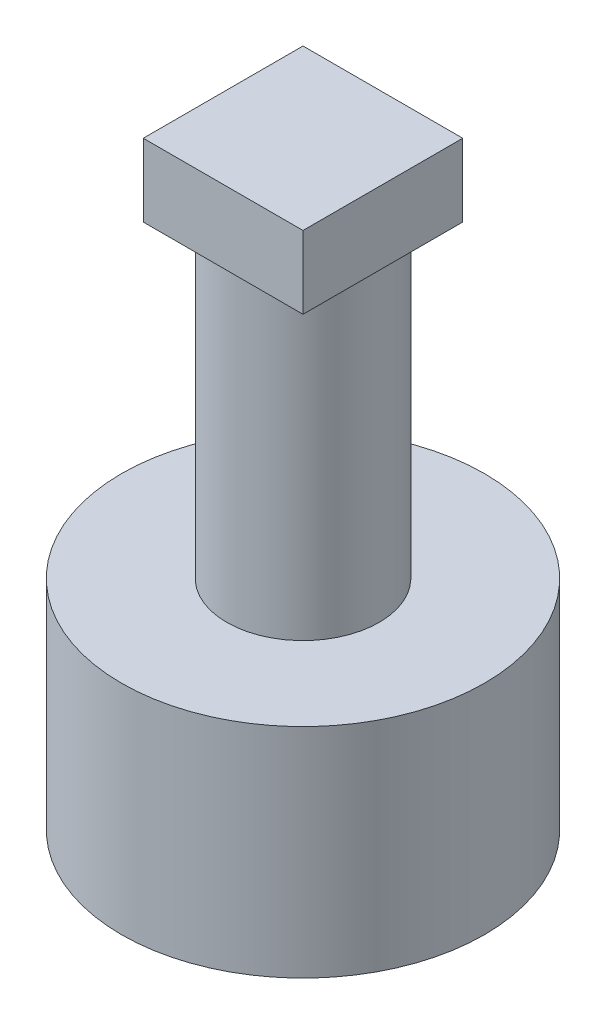
ISO-10303-21;
HEADER;
FILE_DESCRIPTION(('STEP AP214'),'2;1');
FILE_NAME('part.step','',(''),(''),'','','');
FILE_SCHEMA(('AUTOMOTIVE_DESIGN { 1 0 10303 214 1 1 1 1 }'));
ENDSEC;
DATA;
#1=APPLICATION_CONTEXT('core data for automotive mechanical design processes');
#2=APPLICATION_PROTOCOL_DEFINITION('international standard','automotive_design',2000,#1);
#3=PRODUCT_CONTEXT('',#1,'mechanical');
#4=PRODUCT('Part','Part','',(#3));
#5=PRODUCT_RELATED_PRODUCT_CATEGORY('part','',(#4));
#6=PRODUCT_DEFINITION_FORMATION('','',#4);
#7=PRODUCT_DEFINITION_CONTEXT('part definition',#1,'design');
#8=PRODUCT_DEFINITION('design','',#6,#7);
#9=PRODUCT_DEFINITION_SHAPE('','',#8);
#10=(LENGTH_UNIT() NAMED_UNIT(*) SI_UNIT(.MILLI.,.METRE.));
#11=(NAMED_UNIT(*) PLANE_ANGLE_UNIT() SI_UNIT($,.RADIAN.));
#12=(NAMED_UNIT(*) SI_UNIT($,.STERADIAN.) SOLID_ANGLE_UNIT());
#13=UNCERTAINTY_MEASURE_WITH_UNIT(LENGTH_MEASURE(1.E-05),#10,'distance_accuracy_value','');
#14=(GEOMETRIC_REPRESENTATION_CONTEXT(3) GLOBAL_UNCERTAINTY_ASSIGNED_CONTEXT((#13)) GLOBAL_UNIT_ASSIGNED_CONTEXT((#10,
#11,#12)) REPRESENTATION_CONTEXT('',''));
#15=CARTESIAN_POINT('',(0.,0.,0.));
#16=DIRECTION('',(0.,0.,1.));
#17=DIRECTION('',(1.,0.,0.));
#18=AXIS2_PLACEMENT_3D('',#15,#16,#17);
#19=CARTESIAN_POINT('',(0.,0.,0.));
#20=DIRECTION('',(0.,1.,0.));
#21=DIRECTION('',(0.,0.,1.));
#22=AXIS2_PLACEMENT_3D('',#19,#20,#21);
#23=PLANE('',#22);
#24=CARTESIAN_POINT('',(0.,0.,0.));
#25=DIRECTION('',(0.,1.,0.));
#26=DIRECTION('',(0.,0.,1.));
#27=AXIS2_PLACEMENT_3D('',#24,#25,#26);
#28=CIRCLE('',#27,5.);
#29=CARTESIAN_POINT('',(0.,0.,5.));
#30=VERTEX_POINT('',#29);
#31=EDGE_CURVE('E43',#30,#30,#28,.T.);
#32=ORIENTED_EDGE('',*,*,#31,.F.);
#33=EDGE_LOOP('',(#32));
#34=FACE_BOUND('',#33,.T.);
#35=DIRECTION('',(0.,0.,-1.));
#36=VECTOR('',#35,1.);
#37=CARTESIAN_POINT('',(3.3,0.,-2.55));
#38=LINE('',#37,#36);
#39=CARTESIAN_POINT('',(3.3,0.,2.55));
#40=VERTEX_POINT('',#39);
#41=CARTESIAN_POINT('',(3.3,0.,-2.55));
#42=VERTEX_POINT('',#41);
#43=EDGE_CURVE('E64',#40,#42,#38,.T.);
#44=ORIENTED_EDGE('',*,*,#43,.T.);
#45=DIRECTION('',(-1.,0.,0.));
#46=VECTOR('',#45,1.);
#47=CARTESIAN_POINT('',(-3.3,0.,-2.55));
#48=LINE('',#47,#46);
#49=CARTESIAN_POINT('',(-3.3,0.,-2.55));
#50=VERTEX_POINT('',#49);
#51=EDGE_CURVE('E168',#42,#50,#48,.T.);
#52=ORIENTED_EDGE('',*,*,#51,.T.);
#53=DIRECTION('',(0.,0.,1.));
#54=VECTOR('',#53,1.);
#55=CARTESIAN_POINT('',(-3.3,0.,-2.55));
#56=LINE('',#55,#54);
#57=CARTESIAN_POINT('',(-3.3,0.,2.55));
#58=VERTEX_POINT('',#57);
#59=EDGE_CURVE('E172',#50,#58,#56,.T.);
#60=ORIENTED_EDGE('',*,*,#59,.T.);
#61=DIRECTION('',(1.,0.,0.));
#62=VECTOR('',#61,1.);
#63=CARTESIAN_POINT('',(-3.3,0.,2.55));
#64=LINE('',#63,#62);
#65=EDGE_CURVE('E155',#58,#40,#64,.T.);
#66=ORIENTED_EDGE('',*,*,#65,.T.);
#67=EDGE_LOOP('',(#44,#52,#60,#66));
#68=FACE_BOUND('',#67,.T.);
#69=ADVANCED_FACE('F39',(#34,#68),#23,.F.);
#70=CARTESIAN_POINT('',(0.,5.,0.));
#71=DIRECTION('',(0.,-1.,0.));
#72=DIRECTION('',(0.,0.,-1.));
#73=AXIS2_PLACEMENT_3D('',#70,#71,#72);
#74=CYLINDRICAL_SURFACE('',#73,5.);
#75=ORIENTED_EDGE('',*,*,#31,.T.);
#76=EDGE_LOOP('',(#75));
#77=FACE_BOUND('',#76,.T.);
#78=CARTESIAN_POINT('',(0.,6.,0.));
#79=DIRECTION('',(0.,1.,0.));
#80=DIRECTION('',(0.,0.,1.));
#81=AXIS2_PLACEMENT_3D('',#78,#79,#80);
#82=CIRCLE('',#81,5.);
#83=CARTESIAN_POINT('',(0.,6.,5.));
#84=VERTEX_POINT('',#83);
#85=EDGE_CURVE('E141',#84,#84,#82,.T.);
#86=ORIENTED_EDGE('',*,*,#85,.F.);
#87=EDGE_LOOP('',(#86));
#88=FACE_BOUND('',#87,.T.);
#89=ADVANCED_FACE('F41',(#77,#88),#74,.T.);
#90=CARTESIAN_POINT('',(3.3,5.,-2.55));
#91=DIRECTION('',(-1.,0.,0.));
#92=DIRECTION('',(0.,0.,1.));
#93=AXIS2_PLACEMENT_3D('',#90,#91,#92);
#94=PLANE('',#93);
#95=ORIENTED_EDGE('',*,*,#43,.F.);
#96=DIRECTION('',(0.,-1.,0.));
#97=VECTOR('',#96,1.);
#98=CARTESIAN_POINT('',(3.3,5.,2.55));
#99=LINE('',#98,#97);
#100=CARTESIAN_POINT('',(3.3,5.,2.55));
#101=VERTEX_POINT('',#100);
#102=EDGE_CURVE('E165',#101,#40,#99,.T.);
#103=ORIENTED_EDGE('',*,*,#102,.F.);
#104=DIRECTION('',(0.,0.,-1.));
#105=VECTOR('',#104,1.);
#106=CARTESIAN_POINT('',(3.3,5.,-2.55));
#107=LINE('',#106,#105);
#108=CARTESIAN_POINT('',(3.3,5.,-2.55));
#109=VERTEX_POINT('',#108);
#110=EDGE_CURVE('E150',#101,#109,#107,.T.);
#111=ORIENTED_EDGE('',*,*,#110,.T.);
#112=DIRECTION('',(0.,-1.,0.));
#113=VECTOR('',#112,1.);
#114=CARTESIAN_POINT('',(3.3,5.,-2.55));
#115=LINE('',#114,#113);
#116=EDGE_CURVE('E186',#109,#42,#115,.T.);
#117=ORIENTED_EDGE('',*,*,#116,.T.);
#118=EDGE_LOOP('',(#95,#103,#111,#117));
#119=FACE_BOUND('',#118,.T.);
#120=ADVANCED_FACE('F201',(#119),#94,.T.);
#121=CARTESIAN_POINT('',(-3.3,5.,-2.55));
#122=DIRECTION('',(0.,0.,1.));
#123=DIRECTION('',(1.,0.,0.));
#124=AXIS2_PLACEMENT_3D('',#121,#122,#123);
#125=PLANE('',#124);
#126=ORIENTED_EDGE('',*,*,#51,.F.);
#127=ORIENTED_EDGE('',*,*,#116,.F.);
#128=DIRECTION('',(-1.,0.,0.));
#129=VECTOR('',#128,1.);
#130=CARTESIAN_POINT('',(-3.3,5.,-2.55));
#131=LINE('',#130,#129);
#132=CARTESIAN_POINT('',(-3.3,5.,-2.55));
#133=VERTEX_POINT('',#132);
#134=EDGE_CURVE('E154',#109,#133,#131,.T.);
#135=ORIENTED_EDGE('',*,*,#134,.T.);
#136=DIRECTION('',(0.,-1.,0.));
#137=VECTOR('',#136,1.);
#138=CARTESIAN_POINT('',(-3.3,5.,-2.55));
#139=LINE('',#138,#137);
#140=EDGE_CURVE('E184',#133,#50,#139,.T.);
#141=ORIENTED_EDGE('',*,*,#140,.T.);
#142=EDGE_LOOP('',(#126,#127,#135,#141));
#143=FACE_BOUND('',#142,.T.);
#144=ADVANCED_FACE('F203',(#143),#125,.T.);
#145=CARTESIAN_POINT('',(-3.3,5.,-2.55));
#146=DIRECTION('',(1.,0.,0.));
#147=DIRECTION('',(0.,0.,-1.));
#148=AXIS2_PLACEMENT_3D('',#145,#146,#147);
#149=PLANE('',#148);
#150=ORIENTED_EDGE('',*,*,#59,.F.);
#151=ORIENTED_EDGE('',*,*,#140,.F.);
#152=DIRECTION('',(0.,0.,1.));
#153=VECTOR('',#152,1.);
#154=CARTESIAN_POINT('',(-3.3,5.,-2.55));
#155=LINE('',#154,#153);
#156=CARTESIAN_POINT('',(-3.3,5.,2.55));
#157=VERTEX_POINT('',#156);
#158=EDGE_CURVE('E159',#133,#157,#155,.T.);
#159=ORIENTED_EDGE('',*,*,#158,.T.);
#160=DIRECTION('',(0.,-1.,0.));
#161=VECTOR('',#160,1.);
#162=CARTESIAN_POINT('',(-3.3,5.,2.55));
#163=LINE('',#162,#161);
#164=EDGE_CURVE('E181',#157,#58,#163,.T.);
#165=ORIENTED_EDGE('',*,*,#164,.T.);
#166=EDGE_LOOP('',(#150,#151,#159,#165));
#167=FACE_BOUND('',#166,.T.);
#168=ADVANCED_FACE('F206',(#167),#149,.T.);
#169=CARTESIAN_POINT('',(-3.3,5.,2.55));
#170=DIRECTION('',(0.,0.,-1.));
#171=DIRECTION('',(-1.,0.,0.));
#172=AXIS2_PLACEMENT_3D('',#169,#170,#171);
#173=PLANE('',#172);
#174=ORIENTED_EDGE('',*,*,#65,.F.);
#175=ORIENTED_EDGE('',*,*,#164,.F.);
#176=DIRECTION('',(1.,0.,0.));
#177=VECTOR('',#176,1.);
#178=CARTESIAN_POINT('',(-3.3,5.,2.55));
#179=LINE('',#178,#177);
#180=EDGE_CURVE('E56',#157,#101,#179,.T.);
#181=ORIENTED_EDGE('',*,*,#180,.T.);
#182=ORIENTED_EDGE('',*,*,#102,.T.);
#183=EDGE_LOOP('',(#174,#175,#181,#182));
#184=FACE_BOUND('',#183,.T.);
#185=ADVANCED_FACE('F200',(#184),#173,.T.);
#186=CARTESIAN_POINT('',(0.,5.,0.));
#187=DIRECTION('',(0.,1.,0.));
#188=DIRECTION('',(0.,0.,1.));
#189=AXIS2_PLACEMENT_3D('',#186,#187,#188);
#190=PLANE('',#189);
#191=ORIENTED_EDGE('',*,*,#134,.F.);
#192=ORIENTED_EDGE('',*,*,#110,.F.);
#193=ORIENTED_EDGE('',*,*,#180,.F.);
#194=ORIENTED_EDGE('',*,*,#158,.F.);
#195=EDGE_LOOP('',(#191,#192,#193,#194));
#196=FACE_BOUND('',#195,.T.);
#197=ADVANCED_FACE('F207',(#196),#190,.F.);
#198=CARTESIAN_POINT('',(0.,6.,0.));
#199=DIRECTION('',(0.,1.,0.));
#200=DIRECTION('',(0.,0.,1.));
#201=AXIS2_PLACEMENT_3D('',#198,#199,#200);
#202=PLANE('',#201);
#203=CARTESIAN_POINT('',(0.,6.,0.));
#204=DIRECTION('',(0.,1.,0.));
#205=DIRECTION('',(0.,0.,1.));
#206=AXIS2_PLACEMENT_3D('',#203,#204,#205);
#207=CIRCLE('',#206,2.1);
#208=CARTESIAN_POINT('',(0.,6.,2.1));
#209=VERTEX_POINT('',#208);
#210=EDGE_CURVE('E11',#209,#209,#207,.T.);
#211=ORIENTED_EDGE('',*,*,#210,.F.);
#212=EDGE_LOOP('',(#211));
#213=FACE_BOUND('',#212,.T.);
#214=ORIENTED_EDGE('',*,*,#85,.T.);
#215=EDGE_LOOP('',(#214));
#216=FACE_BOUND('',#215,.T.);
#217=ADVANCED_FACE('F209',(#213,#216),#202,.T.);
#218=CARTESIAN_POINT('',(0.,14.5,0.));
#219=DIRECTION('',(0.,-1.,0.));
#220=DIRECTION('',(0.,0.,-1.));
#221=AXIS2_PLACEMENT_3D('',#218,#219,#220);
#222=CYLINDRICAL_SURFACE('',#221,2.1);
#223=CARTESIAN_POINT('',(0.,14.5,0.));
#224=DIRECTION('',(0.,1.,0.));
#225=DIRECTION('',(0.,0.,1.));
#226=AXIS2_PLACEMENT_3D('',#223,#224,#225);
#227=CIRCLE('',#226,2.1);
#228=CARTESIAN_POINT('',(0.,14.5,2.1));
#229=VERTEX_POINT('',#228);
#230=EDGE_CURVE('E136',#229,#229,#227,.T.);
#231=ORIENTED_EDGE('',*,*,#230,.F.);
#232=EDGE_LOOP('',(#231));
#233=FACE_BOUND('',#232,.T.);
#234=ORIENTED_EDGE('',*,*,#210,.T.);
#235=EDGE_LOOP('',(#234));
#236=FACE_BOUND('',#235,.T.);
#237=ADVANCED_FACE('F215',(#233,#236),#222,.T.);
#238=CARTESIAN_POINT('',(2.2,16.5,2.2));
#239=DIRECTION('',(-1.,0.,0.));
#240=DIRECTION('',(0.,0.,1.));
#241=AXIS2_PLACEMENT_3D('',#238,#239,#240);
#242=PLANE('',#241);
#243=DIRECTION('',(0.,0.,-1.));
#244=VECTOR('',#243,1.);
#245=CARTESIAN_POINT('',(2.2,14.5,2.2));
#246=LINE('',#245,#244);
#247=CARTESIAN_POINT('',(2.2,14.5,2.2));
#248=VERTEX_POINT('',#247);
#249=CARTESIAN_POINT('',(2.2,14.5,-2.2));
#250=VERTEX_POINT('',#249);
#251=EDGE_CURVE('E134',#248,#250,#246,.T.);
#252=ORIENTED_EDGE('',*,*,#251,.T.);
#253=DIRECTION('',(0.,-1.,0.));
#254=VECTOR('',#253,1.);
#255=CARTESIAN_POINT('',(2.2,16.5,-2.2));
#256=LINE('',#255,#254);
#257=CARTESIAN_POINT('',(2.2,16.5,-2.2));
#258=VERTEX_POINT('',#257);
#259=EDGE_CURVE('E112',#258,#250,#256,.T.);
#260=ORIENTED_EDGE('',*,*,#259,.F.);
#261=DIRECTION('',(0.,0.,-1.));
#262=VECTOR('',#261,1.);
#263=CARTESIAN_POINT('',(2.2,16.5,2.2));
#264=LINE('',#263,#262);
#265=CARTESIAN_POINT('',(2.2,16.5,2.2));
#266=VERTEX_POINT('',#265);
#267=EDGE_CURVE('E120',#266,#258,#264,.T.);
#268=ORIENTED_EDGE('',*,*,#267,.F.);
#269=DIRECTION('',(0.,-1.,0.));
#270=VECTOR('',#269,1.);
#271=CARTESIAN_POINT('',(2.2,16.5,2.2));
#272=LINE('',#271,#270);
#273=EDGE_CURVE('E353',#266,#248,#272,.T.);
#274=ORIENTED_EDGE('',*,*,#273,.T.);
#275=EDGE_LOOP('',(#252,#260,#268,#274));
#276=FACE_BOUND('',#275,.T.);
#277=ADVANCED_FACE('F132',(#276),#242,.F.);
#278=CARTESIAN_POINT('',(-2.2,16.5,-2.2));
#279=DIRECTION('',(0.,0.,1.));
#280=DIRECTION('',(1.,0.,0.));
#281=AXIS2_PLACEMENT_3D('',#278,#279,#280);
#282=PLANE('',#281);
#283=DIRECTION('',(-1.,0.,0.));
#284=VECTOR('',#283,1.);
#285=CARTESIAN_POINT('',(-2.2,14.5,-2.2));
#286=LINE('',#285,#284);
#287=CARTESIAN_POINT('',(-2.2,14.5,-2.2));
#288=VERTEX_POINT('',#287);
#289=EDGE_CURVE('E340',#250,#288,#286,.T.);
#290=ORIENTED_EDGE('',*,*,#289,.T.);
#291=DIRECTION('',(0.,-1.,0.));
#292=VECTOR('',#291,1.);
#293=CARTESIAN_POINT('',(-2.2,16.5,-2.2));
#294=LINE('',#293,#292);
#295=CARTESIAN_POINT('',(-2.2,16.5,-2.2));
#296=VERTEX_POINT('',#295);
#297=EDGE_CURVE('E115',#296,#288,#294,.T.);
#298=ORIENTED_EDGE('',*,*,#297,.F.);
#299=DIRECTION('',(-1.,0.,0.));
#300=VECTOR('',#299,1.);
#301=CARTESIAN_POINT('',(-2.2,16.5,-2.2));
#302=LINE('',#301,#300);
#303=EDGE_CURVE('E108',#258,#296,#302,.T.);
#304=ORIENTED_EDGE('',*,*,#303,.F.);
#305=ORIENTED_EDGE('',*,*,#259,.T.);
#306=EDGE_LOOP('',(#290,#298,#304,#305));
#307=FACE_BOUND('',#306,.T.);
#308=ADVANCED_FACE('F110',(#307),#282,.F.);
#309=CARTESIAN_POINT('',(-2.2,16.5,2.2));
#310=DIRECTION('',(1.,0.,0.));
#311=DIRECTION('',(0.,0.,-1.));
#312=AXIS2_PLACEMENT_3D('',#309,#310,#311);
#313=PLANE('',#312);
#314=DIRECTION('',(0.,0.,1.));
#315=VECTOR('',#314,1.);
#316=CARTESIAN_POINT('',(-2.2,14.5,2.2));
#317=LINE('',#316,#315);
#318=CARTESIAN_POINT('',(-2.2,14.5,2.2));
#319=VERTEX_POINT('',#318);
#320=EDGE_CURVE('E344',#288,#319,#317,.T.);
#321=ORIENTED_EDGE('',*,*,#320,.T.);
#322=DIRECTION('',(0.,-1.,0.));
#323=VECTOR('',#322,1.);
#324=CARTESIAN_POINT('',(-2.2,16.5,2.2));
#325=LINE('',#324,#323);
#326=CARTESIAN_POINT('',(-2.2,16.5,2.2));
#327=VERTEX_POINT('',#326);
#328=EDGE_CURVE('E143',#327,#319,#325,.T.);
#329=ORIENTED_EDGE('',*,*,#328,.F.);
#330=DIRECTION('',(0.,0.,1.));
#331=VECTOR('',#330,1.);
#332=CARTESIAN_POINT('',(-2.2,16.5,2.2));
#333=LINE('',#332,#331);
#334=EDGE_CURVE('E119',#296,#327,#333,.T.);
#335=ORIENTED_EDGE('',*,*,#334,.F.);
#336=ORIENTED_EDGE('',*,*,#297,.T.);
#337=EDGE_LOOP('',(#321,#329,#335,#336));
#338=FACE_BOUND('',#337,.T.);
#339=ADVANCED_FACE('F295',(#338),#313,.F.);
#340=CARTESIAN_POINT('',(-2.2,16.5,2.2));
#341=DIRECTION('',(0.,0.,-1.));
#342=DIRECTION('',(-1.,0.,0.));
#343=AXIS2_PLACEMENT_3D('',#340,#341,#342);
#344=PLANE('',#343);
#345=DIRECTION('',(1.,0.,0.));
#346=VECTOR('',#345,1.);
#347=CARTESIAN_POINT('',(-2.2,14.5,2.2));
#348=LINE('',#347,#346);
#349=EDGE_CURVE('E130',#319,#248,#348,.T.);
#350=ORIENTED_EDGE('',*,*,#349,.T.);
#351=ORIENTED_EDGE('',*,*,#273,.F.);
#352=DIRECTION('',(1.,0.,0.));
#353=VECTOR('',#352,1.);
#354=CARTESIAN_POINT('',(-2.2,16.5,2.2));
#355=LINE('',#354,#353);
#356=EDGE_CURVE('E125',#327,#266,#355,.T.);
#357=ORIENTED_EDGE('',*,*,#356,.F.);
#358=ORIENTED_EDGE('',*,*,#328,.T.);
#359=EDGE_LOOP('',(#350,#351,#357,#358));
#360=FACE_BOUND('',#359,.T.);
#361=ADVANCED_FACE('F304',(#360),#344,.F.);
#362=CARTESIAN_POINT('',(0.,16.5,0.));
#363=DIRECTION('',(0.,-1.,0.));
#364=DIRECTION('',(0.,0.,-1.));
#365=AXIS2_PLACEMENT_3D('',#362,#363,#364);
#366=PLANE('',#365);
#367=ORIENTED_EDGE('',*,*,#267,.T.);
#368=ORIENTED_EDGE('',*,*,#303,.T.);
#369=ORIENTED_EDGE('',*,*,#334,.T.);
#370=ORIENTED_EDGE('',*,*,#356,.T.);
#371=EDGE_LOOP('',(#367,#368,#369,#370));
#372=FACE_BOUND('',#371,.T.);
#373=ADVANCED_FACE('F123',(#372),#366,.F.);
#374=CARTESIAN_POINT('',(0.,14.5,0.));
#375=DIRECTION('',(0.,-1.,0.));
#376=DIRECTION('',(0.,0.,-1.));
#377=AXIS2_PLACEMENT_3D('',#374,#375,#376);
#378=PLANE('',#377);
#379=ORIENTED_EDGE('',*,*,#230,.T.);
#380=EDGE_LOOP('',(#379));
#381=FACE_BOUND('',#380,.T.);
#382=ORIENTED_EDGE('',*,*,#251,.F.);
#383=ORIENTED_EDGE('',*,*,#349,.F.);
#384=ORIENTED_EDGE('',*,*,#320,.F.);
#385=ORIENTED_EDGE('',*,*,#289,.F.);
#386=EDGE_LOOP('',(#382,#383,#384,#385));
#387=FACE_BOUND('',#386,.T.);
#388=ADVANCED_FACE('F323',(#381,#387),#378,.T.);
#389=CLOSED_SHELL('',(#69,#89,#120,#144,#168,#185,#197,#217,#237,#277,#308,#339,#361,#373,#388));
#390=MANIFOLD_SOLID_BREP('B2',#389);
#391=ADVANCED_BREP_SHAPE_REPRESENTATION('',(#18,#390),#14);
#392=SHAPE_DEFINITION_REPRESENTATION(#9,#391);
ENDSEC;
END-ISO-10303-21;
